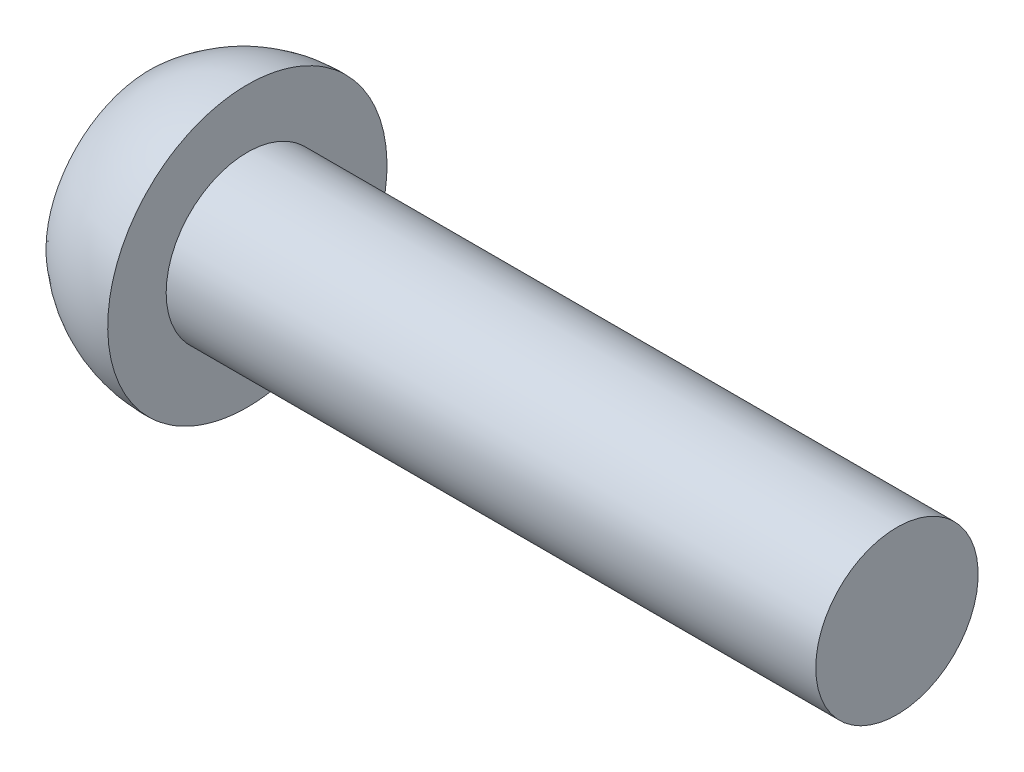
ISO-10303-21;
HEADER;
FILE_DESCRIPTION(('STEP AP214'),'2;1');
FILE_NAME('part.step','',(''),(''),'','','');
FILE_SCHEMA(('AUTOMOTIVE_DESIGN { 1 0 10303 214 1 1 1 1 }'));
ENDSEC;
DATA;
#1=APPLICATION_CONTEXT('core data for automotive mechanical design processes');
#2=APPLICATION_PROTOCOL_DEFINITION('international standard','automotive_design',2000,#1);
#3=PRODUCT_CONTEXT('',#1,'mechanical');
#4=PRODUCT('Part','Part','',(#3));
#5=PRODUCT_RELATED_PRODUCT_CATEGORY('part','',(#4));
#6=PRODUCT_DEFINITION_FORMATION('','',#4);
#7=PRODUCT_DEFINITION_CONTEXT('part definition',#1,'design');
#8=PRODUCT_DEFINITION('design','',#6,#7);
#9=PRODUCT_DEFINITION_SHAPE('','',#8);
#10=(LENGTH_UNIT() NAMED_UNIT(*) SI_UNIT(.MILLI.,.METRE.));
#11=(NAMED_UNIT(*) PLANE_ANGLE_UNIT() SI_UNIT($,.RADIAN.));
#12=(NAMED_UNIT(*) SI_UNIT($,.STERADIAN.) SOLID_ANGLE_UNIT());
#13=UNCERTAINTY_MEASURE_WITH_UNIT(LENGTH_MEASURE(1.E-05),#10,'distance_accuracy_value','');
#14=(GEOMETRIC_REPRESENTATION_CONTEXT(3) GLOBAL_UNCERTAINTY_ASSIGNED_CONTEXT((#13)) GLOBAL_UNIT_ASSIGNED_CONTEXT((#10,
#11,#12)) REPRESENTATION_CONTEXT('',''));
#15=CARTESIAN_POINT('',(0.,0.,0.));
#16=DIRECTION('',(0.,0.,1.));
#17=DIRECTION('',(1.,0.,0.));
#18=AXIS2_PLACEMENT_3D('',#15,#16,#17);
#19=CARTESIAN_POINT('',(1.3,0.,0.));
#20=DIRECTION('',(-1.,0.,0.));
#21=DIRECTION('',(0.,0.,1.));
#22=AXIS2_PLACEMENT_3D('',#19,#20,#21);
#23=PLANE('',#22);
#24=DIRECTION('',(0.,0.866025403784439,-0.5));
#25=VECTOR('',#24,1.);
#26=CARTESIAN_POINT('',(1.3,0.,-0.866025403784439));
#27=LINE('',#26,#25);
#28=CARTESIAN_POINT('',(1.3,0.,-0.866025403784439));
#29=VERTEX_POINT('',#28);
#30=CARTESIAN_POINT('',(1.3,-0.75,-0.43301270189222));
#31=VERTEX_POINT('',#30);
#32=EDGE_CURVE('E122',#29,#31,#27,.F.);
#33=ORIENTED_EDGE('',*,*,#32,.T.);
#34=DIRECTION('',(0.,0.,-1.));
#35=VECTOR('',#34,1.);
#36=CARTESIAN_POINT('',(1.3,-0.75,-0.43301270189222));
#37=LINE('',#36,#35);
#38=CARTESIAN_POINT('',(1.3,-0.75,0.433012701892219));
#39=VERTEX_POINT('',#38);
#40=EDGE_CURVE('E117',#31,#39,#37,.F.);
#41=ORIENTED_EDGE('',*,*,#40,.T.);
#42=DIRECTION('',(0.,-0.866025403784439,-0.5));
#43=VECTOR('',#42,1.);
#44=CARTESIAN_POINT('',(1.3,-0.75,0.433012701892219));
#45=LINE('',#44,#43);
#46=CARTESIAN_POINT('',(1.3,0.,0.866025403784439));
#47=VERTEX_POINT('',#46);
#48=EDGE_CURVE('E95',#39,#47,#45,.F.);
#49=ORIENTED_EDGE('',*,*,#48,.T.);
#50=DIRECTION('',(0.,-0.866025403784439,0.5));
#51=VECTOR('',#50,1.);
#52=CARTESIAN_POINT('',(1.3,0.,0.866025403784439));
#53=LINE('',#52,#51);
#54=CARTESIAN_POINT('',(1.3,0.750000000000001,0.433012701892219));
#55=VERTEX_POINT('',#54);
#56=EDGE_CURVE('E94',#47,#55,#53,.F.);
#57=ORIENTED_EDGE('',*,*,#56,.T.);
#58=DIRECTION('',(0.,0.,1.));
#59=VECTOR('',#58,1.);
#60=CARTESIAN_POINT('',(1.3,0.750000000000001,0.433012701892219));
#61=LINE('',#60,#59);
#62=CARTESIAN_POINT('',(1.3,0.750000000000001,-0.43301270189222));
#63=VERTEX_POINT('',#62);
#64=EDGE_CURVE('E132',#55,#63,#61,.F.);
#65=ORIENTED_EDGE('',*,*,#64,.T.);
#66=DIRECTION('',(0.,0.866025403784439,0.5));
#67=VECTOR('',#66,1.);
#68=CARTESIAN_POINT('',(1.3,0.750000000000001,-0.43301270189222));
#69=LINE('',#68,#67);
#70=EDGE_CURVE('E127',#63,#29,#69,.F.);
#71=ORIENTED_EDGE('',*,*,#70,.T.);
#72=EDGE_LOOP('',(#33,#41,#49,#57,#65,#71));
#73=FACE_BOUND('',#72,.T.);
#74=ADVANCED_FACE('F17',(#73),#23,.T.);
#75=CARTESIAN_POINT('',(1.3,0.750000000000001,0.433012701892219));
#76=DIRECTION('',(0.,1.,0.));
#77=DIRECTION('',(0.,0.,1.));
#78=AXIS2_PLACEMENT_3D('',#75,#76,#77);
#79=PLANE('',#78);
#80=DIRECTION('',(1.,0.,0.));
#81=VECTOR('',#80,1.);
#82=CARTESIAN_POINT('',(1.3,0.750000000000001,-0.43301270189222));
#83=LINE('',#82,#81);
#84=CARTESIAN_POINT('',(0.,0.750000000000001,-0.43301270189222));
#85=VERTEX_POINT('',#84);
#86=EDGE_CURVE('E129',#85,#63,#83,.T.);
#87=ORIENTED_EDGE('',*,*,#86,.T.);
#88=ORIENTED_EDGE('',*,*,#64,.F.);
#89=DIRECTION('',(1.,0.,0.));
#90=VECTOR('',#89,1.);
#91=CARTESIAN_POINT('',(1.3,0.750000000000001,0.433012701892219));
#92=LINE('',#91,#90);
#93=CARTESIAN_POINT('',(0.,0.750000000000001,0.433012701892219));
#94=VERTEX_POINT('',#93);
#95=EDGE_CURVE('E112',#55,#94,#92,.F.);
#96=ORIENTED_EDGE('',*,*,#95,.T.);
#97=DIRECTION('',(0.,0.,-1.));
#98=VECTOR('',#97,1.);
#99=CARTESIAN_POINT('',(0.,0.750000000000001,0.));
#100=LINE('',#99,#98);
#101=EDGE_CURVE('E99',#94,#85,#100,.T.);
#102=ORIENTED_EDGE('',*,*,#101,.T.);
#103=EDGE_LOOP('',(#87,#88,#96,#102));
#104=FACE_BOUND('',#103,.T.);
#105=ADVANCED_FACE('F167',(#104),#79,.F.);
#106=CARTESIAN_POINT('',(1.3,0.750000000000001,-0.43301270189222));
#107=DIRECTION('',(0.,0.5,-0.866025403784439));
#108=DIRECTION('',(0.,0.866025403784439,0.5));
#109=AXIS2_PLACEMENT_3D('',#106,#107,#108);
#110=PLANE('',#109);
#111=DIRECTION('',(1.,0.,0.));
#112=VECTOR('',#111,1.);
#113=CARTESIAN_POINT('',(1.3,0.,-0.866025403784439));
#114=LINE('',#113,#112);
#115=CARTESIAN_POINT('',(0.,0.,-0.866025403784439));
#116=VERTEX_POINT('',#115);
#117=EDGE_CURVE('E124',#116,#29,#114,.T.);
#118=ORIENTED_EDGE('',*,*,#117,.T.);
#119=ORIENTED_EDGE('',*,*,#70,.F.);
#120=ORIENTED_EDGE('',*,*,#86,.F.);
#121=DIRECTION('',(0.,-0.866025403784439,-0.5));
#122=VECTOR('',#121,1.);
#123=CARTESIAN_POINT('',(0.,0.750000000000001,-0.43301270189222));
#124=LINE('',#123,#122);
#125=EDGE_CURVE('E109',#85,#116,#124,.T.);
#126=ORIENTED_EDGE('',*,*,#125,.T.);
#127=EDGE_LOOP('',(#118,#119,#120,#126));
#128=FACE_BOUND('',#127,.T.);
#129=ADVANCED_FACE('F164',(#128),#110,.F.);
#130=CARTESIAN_POINT('',(1.3,0.,-0.866025403784439));
#131=DIRECTION('',(0.,-0.5,-0.866025403784439));
#132=DIRECTION('',(0.,0.866025403784439,-0.5));
#133=AXIS2_PLACEMENT_3D('',#130,#131,#132);
#134=PLANE('',#133);
#135=DIRECTION('',(1.,0.,0.));
#136=VECTOR('',#135,1.);
#137=CARTESIAN_POINT('',(1.3,-0.75,-0.43301270189222));
#138=LINE('',#137,#136);
#139=CARTESIAN_POINT('',(0.,-0.75,-0.43301270189222));
#140=VERTEX_POINT('',#139);
#141=EDGE_CURVE('E119',#140,#31,#138,.T.);
#142=ORIENTED_EDGE('',*,*,#141,.T.);
#143=ORIENTED_EDGE('',*,*,#32,.F.);
#144=ORIENTED_EDGE('',*,*,#117,.F.);
#145=DIRECTION('',(0.,-0.866025403784439,0.5));
#146=VECTOR('',#145,1.);
#147=CARTESIAN_POINT('',(0.,0.,-0.866025403784439));
#148=LINE('',#147,#146);
#149=EDGE_CURVE('E107',#116,#140,#148,.T.);
#150=ORIENTED_EDGE('',*,*,#149,.T.);
#151=EDGE_LOOP('',(#142,#143,#144,#150));
#152=FACE_BOUND('',#151,.T.);
#153=ADVANCED_FACE('F160',(#152),#134,.F.);
#154=CARTESIAN_POINT('',(1.3,-0.75,-0.43301270189222));
#155=DIRECTION('',(0.,-1.,0.));
#156=DIRECTION('',(0.,0.,-1.));
#157=AXIS2_PLACEMENT_3D('',#154,#155,#156);
#158=PLANE('',#157);
#159=DIRECTION('',(1.,0.,0.));
#160=VECTOR('',#159,1.);
#161=CARTESIAN_POINT('',(1.3,-0.75,0.433012701892219));
#162=LINE('',#161,#160);
#163=CARTESIAN_POINT('',(0.,-0.75,0.433012701892219));
#164=VERTEX_POINT('',#163);
#165=EDGE_CURVE('E82',#164,#39,#162,.T.);
#166=ORIENTED_EDGE('',*,*,#165,.T.);
#167=ORIENTED_EDGE('',*,*,#40,.F.);
#168=ORIENTED_EDGE('',*,*,#141,.F.);
#169=DIRECTION('',(0.,0.,-1.));
#170=VECTOR('',#169,1.);
#171=CARTESIAN_POINT('',(0.,-0.75,0.));
#172=LINE('',#171,#170);
#173=EDGE_CURVE('E87',#140,#164,#172,.F.);
#174=ORIENTED_EDGE('',*,*,#173,.T.);
#175=EDGE_LOOP('',(#166,#167,#168,#174));
#176=FACE_BOUND('',#175,.T.);
#177=ADVANCED_FACE('F157',(#176),#158,.F.);
#178=CARTESIAN_POINT('',(1.3,-0.75,0.433012701892219));
#179=DIRECTION('',(0.,-0.5,0.866025403784439));
#180=DIRECTION('',(0.,-0.866025403784439,-0.5));
#181=AXIS2_PLACEMENT_3D('',#178,#179,#180);
#182=PLANE('',#181);
#183=DIRECTION('',(1.,0.,0.));
#184=VECTOR('',#183,1.);
#185=CARTESIAN_POINT('',(1.3,0.,0.866025403784439));
#186=LINE('',#185,#184);
#187=CARTESIAN_POINT('',(0.,0.,0.866025403784439));
#188=VERTEX_POINT('',#187);
#189=EDGE_CURVE('E79',#188,#47,#186,.T.);
#190=ORIENTED_EDGE('',*,*,#189,.T.);
#191=ORIENTED_EDGE('',*,*,#48,.F.);
#192=ORIENTED_EDGE('',*,*,#165,.F.);
#193=DIRECTION('',(0.,0.866025403784439,0.5));
#194=VECTOR('',#193,1.);
#195=CARTESIAN_POINT('',(0.,-0.75,0.433012701892219));
#196=LINE('',#195,#194);
#197=EDGE_CURVE('E75',#164,#188,#196,.T.);
#198=ORIENTED_EDGE('',*,*,#197,.T.);
#199=EDGE_LOOP('',(#190,#191,#192,#198));
#200=FACE_BOUND('',#199,.T.);
#201=ADVANCED_FACE('F77',(#200),#182,.F.);
#202=CARTESIAN_POINT('',(1.3,0.,0.866025403784439));
#203=DIRECTION('',(0.,0.5,0.866025403784439));
#204=DIRECTION('',(0.,-0.866025403784439,0.5));
#205=AXIS2_PLACEMENT_3D('',#202,#203,#204);
#206=PLANE('',#205);
#207=ORIENTED_EDGE('',*,*,#95,.F.);
#208=ORIENTED_EDGE('',*,*,#56,.F.);
#209=ORIENTED_EDGE('',*,*,#189,.F.);
#210=DIRECTION('',(0.,0.866025403784438,-0.5));
#211=VECTOR('',#210,1.);
#212=CARTESIAN_POINT('',(0.,0.,0.866025403784439));
#213=LINE('',#212,#211);
#214=EDGE_CURVE('E86',#188,#94,#213,.T.);
#215=ORIENTED_EDGE('',*,*,#214,.T.);
#216=EDGE_LOOP('',(#207,#208,#209,#215));
#217=FACE_BOUND('',#216,.T.);
#218=ADVANCED_FACE('F92',(#217),#206,.F.);
#219=CARTESIAN_POINT('',(0.,0.,0.));
#220=DIRECTION('',(1.,0.,0.));
#221=DIRECTION('',(0.,0.,-1.));
#222=AXIS2_PLACEMENT_3D('',#219,#220,#221);
#223=PLANE('',#222);
#224=CARTESIAN_POINT('',(0.,-1.6,0.));
#225=CARTESIAN_POINT('',(0.,-1.59999491518665,-0.0898058509638306));
#226=CARTESIAN_POINT('',(0.,-1.59239736388203,-0.179771530910243));
#227=CARTESIAN_POINT('',(0.,-1.56978992308509,-0.312728167692751));
#228=CARTESIAN_POINT('',(0.,-1.56036587642752,-0.356771412883457));
#229=CARTESIAN_POINT('',(0.,-1.53783419346895,-0.443950963914646));
#230=CARTESIAN_POINT('',(0.,-1.5247235679119,-0.48708650310837));
#231=CARTESIAN_POINT('',(0.,-1.48004217995571,-0.614451130943199));
#232=CARTESIAN_POINT('',(0.,-1.44308520787159,-0.696852605605152));
#233=CARTESIAN_POINT('',(0.,-1.35584377899948,-0.85427489605982));
#234=CARTESIAN_POINT('',(0.,-1.30555881557725,-0.929295431133681));
#235=CARTESIAN_POINT('',(0.,-1.22127322709011,-1.03466103704234));
#236=CARTESIAN_POINT('',(0.,-1.19167941852751,-1.06860855571372));
#237=CARTESIAN_POINT('',(0.,-1.1297705032421,-1.13386057270216));
#238=CARTESIAN_POINT('',(0.,-1.09745804777059,-1.16516758773178));
#239=CARTESIAN_POINT('',(0.,-0.996701026779465,-1.25485382359385));
#240=CARTESIAN_POINT('',(4.88071489761702E-13,-0.924418538826696,-1.30902102616723));
#241=CARTESIAN_POINT('',(5.06358398008253E-13,-0.771824869028212,-1.40441928098726));
#242=CARTESIAN_POINT('',(1.25899995619696E-13,-0.691513990071576,-1.44565082101812));
#243=CARTESIAN_POINT('',(-1.2633232947423E-13,-0.525101026398086,-1.51405320165092));
#244=CARTESIAN_POINT('',(0.,-0.438999003544449,-1.5412241924261));
#245=CARTESIAN_POINT('',(0.,-0.263457424015022,-1.58072311132482));
#246=CARTESIAN_POINT('',(0.,-0.174017849517922,-1.59305096017971));
#247=CARTESIAN_POINT('',(0.,0.00566154321391756,-1.60251724502694));
#248=CARTESIAN_POINT('',(0.,0.0959013614486572,-1.59965568101928));
#249=CARTESIAN_POINT('',(0.,0.274621585558607,-1.57882080084403));
#250=CARTESIAN_POINT('',(0.,0.36310200082716,-1.56084756537889));
#251=CARTESIAN_POINT('',(0.,0.535781232283187,-1.51031002311048));
#252=CARTESIAN_POINT('',(0.,0.619980002729658,-1.47774556046492));
#253=CARTESIAN_POINT('',(0.,0.781753087162714,-1.39890950121346));
#254=CARTESIAN_POINT('',(0.,0.859327151191862,-1.35263738769698));
#255=CARTESIAN_POINT('',(0.,0.968950348090436,-1.27403488847543));
#256=CARTESIAN_POINT('',(0.,1.00437357091571,-1.24629648092676));
#257=CARTESIAN_POINT('',(0.,1.07279624806872,-1.18791089397156));
#258=CARTESIAN_POINT('',(0.,1.10579333027074,-1.15726093319933));
#259=CARTESIAN_POINT('',(0.,1.20068381960412,-1.06133509533902));
#260=CARTESIAN_POINT('',(0.,1.25857334024562,-0.992013658329663));
#261=CARTESIAN_POINT('',(0.,1.36187326511285,-0.844629907644365));
#262=CARTESIAN_POINT('',(0.,1.40728414367107,-0.766567926368835));
#263=CARTESIAN_POINT('',(0.,1.46510126811183,-0.644603361947047));
#264=CARTESIAN_POINT('',(0.,1.48267186599164,-0.603084241843454));
#265=CARTESIAN_POINT('',(0.,1.51423937825136,-0.5187548695899));
#266=CARTESIAN_POINT('',(0.,1.52823918478214,-0.475945693944563));
#267=CARTESIAN_POINT('',(0.,1.56469215271815,-0.346100614051025));
#268=CARTESIAN_POINT('',(0.,1.58170096526363,-0.257431303408398));
#269=CARTESIAN_POINT('',(0.,1.59409497697703,-0.140196048457547));
#270=CARTESIAN_POINT('',(0.,1.59630744933613,-0.112206483865384));
#271=CARTESIAN_POINT('',(0.,1.59926075587053,-0.0561498224386112));
#272=CARTESIAN_POINT('',(0.,1.60000159004582,-0.0280827256040015));
#273=CARTESIAN_POINT('',(0.,1.59999491518664,0.0898058509638303));
#274=CARTESIAN_POINT('',(0.,1.59239736388203,0.179771530910243));
#275=CARTESIAN_POINT('',(0.,1.56978992308509,0.31272816769275));
#276=CARTESIAN_POINT('',(0.,1.56036587642752,0.356771412883456));
#277=CARTESIAN_POINT('',(0.,1.53783419346895,0.443950963914646));
#278=CARTESIAN_POINT('',(0.,1.5247235679119,0.48708650310837));
#279=CARTESIAN_POINT('',(0.,1.48004217995571,0.614451130943199));
#280=CARTESIAN_POINT('',(0.,1.44308520787159,0.696852605605151));
#281=CARTESIAN_POINT('',(0.,1.35584377899948,0.85427489605982));
#282=CARTESIAN_POINT('',(0.,1.30555881557725,0.929295431133682));
#283=CARTESIAN_POINT('',(0.,1.22127322709011,1.03466103704234));
#284=CARTESIAN_POINT('',(0.,1.19167941852751,1.06860855571372));
#285=CARTESIAN_POINT('',(0.,1.1297705032421,1.13386057270216));
#286=CARTESIAN_POINT('',(0.,1.09745804777059,1.16516758773178));
#287=CARTESIAN_POINT('',(0.,0.996701026779466,1.25485382359385));
#288=CARTESIAN_POINT('',(4.88857800109033E-13,0.924418538826696,1.30902102616723));
#289=CARTESIAN_POINT('',(5.07306808080206E-13,0.771824869028211,1.40441928098726));
#290=CARTESIAN_POINT('',(1.26617553826069E-13,0.691513990071576,1.44565082101812));
#291=CARTESIAN_POINT('',(-1.27049880016587E-13,0.525101026398085,1.51405320165092));
#292=CARTESIAN_POINT('',(0.,0.438999003544449,1.5412241924261));
#293=CARTESIAN_POINT('',(0.,0.263457424015022,1.58072311132482));
#294=CARTESIAN_POINT('',(0.,0.174017849517922,1.59305096017971));
#295=CARTESIAN_POINT('',(0.,-0.00566154321391741,1.60251724502694));
#296=CARTESIAN_POINT('',(0.,-0.0959013614486569,1.59965568101928));
#297=CARTESIAN_POINT('',(0.,-0.274621585558607,1.57882080084403));
#298=CARTESIAN_POINT('',(0.,-0.36310200082716,1.56084756537889));
#299=CARTESIAN_POINT('',(0.,-0.535781232283187,1.51031002311048));
#300=CARTESIAN_POINT('',(0.,-0.619980002729657,1.47774556046492));
#301=CARTESIAN_POINT('',(0.,-0.781753087162714,1.39890950121346));
#302=CARTESIAN_POINT('',(0.,-0.859327151191862,1.35263738769698));
#303=CARTESIAN_POINT('',(0.,-0.968950348090436,1.27403488847543));
#304=CARTESIAN_POINT('',(0.,-1.00437357091571,1.24629648092676));
#305=CARTESIAN_POINT('',(0.,-1.07279624806872,1.18791089397156));
#306=CARTESIAN_POINT('',(0.,-1.10579333027074,1.15726093319933));
#307=CARTESIAN_POINT('',(0.,-1.20068381960412,1.06133509533902));
#308=CARTESIAN_POINT('',(0.,-1.25857334024562,0.992013658329663));
#309=CARTESIAN_POINT('',(0.,-1.36187326511285,0.844629907644366));
#310=CARTESIAN_POINT('',(0.,-1.40728414367107,0.766567926368836));
#311=CARTESIAN_POINT('',(0.,-1.46510126811183,0.644603361947048));
#312=CARTESIAN_POINT('',(0.,-1.48267186599164,0.603084241843456));
#313=CARTESIAN_POINT('',(0.,-1.51423937825136,0.518754869589902));
#314=CARTESIAN_POINT('',(0.,-1.52823918478214,0.475945693944565));
#315=CARTESIAN_POINT('',(0.,-1.56469215271815,0.346100614051027));
#316=CARTESIAN_POINT('',(0.,-1.58170096526363,0.257431303408399));
#317=CARTESIAN_POINT('',(0.,-1.59409497697703,0.140196048457548));
#318=CARTESIAN_POINT('',(0.,-1.59630744933613,0.112206483865385));
#319=CARTESIAN_POINT('',(0.,-1.59926075587053,0.0561498224386115));
#320=CARTESIAN_POINT('',(0.,-1.60000159004582,0.0280827256040015));
#321=CARTESIAN_POINT('',(0.,-1.6,0.));
#322=B_SPLINE_CURVE_WITH_KNOTS('',3,(#224,#225,#226,#227,#228,#229,#230,#231,#232,#233,#234,
#235,#236,#237,#238,#239,#240,#241,#242,#243,#244,#245,#246,#247,#248,#249,#250,#251,#252,#253,
#254,#255,#256,#257,#258,#259,#260,#261,#262,#263,#264,#265,#266,#267,#268,#269,#270,#271,#272,
#273,#274,#275,#276,#277,#278,#279,#280,#281,#282,#283,#284,#285,#286,#287,#288,#289,#290,#291,
#292,#293,#294,#295,#296,#297,#298,#299,#300,#301,#302,#303,#304,#305,#306,#307,#308,#309,#310,
#311,#312,#313,#314,#315,#316,#317,#318,#319,#320,#321),.UNSPECIFIED.,.T.,.F.,(4,2,2,2,2,2,2,2,
2,2,2,2,2,2,2,2,2,2,2,2,2,2,2,2,2,2,2,2,2,2,2,2,2,2,2,2,2,2,2,2,2,2,2,2,2,2,2,2,4),(0.,
0.269286876383114,0.404284233131455,0.539391369473015,0.808961602399114,1.07854208391437,
1.21350895024238,1.34834568818316,1.617932651975,1.88750944882891,2.15708336641741,
2.42665872363845,2.69623408085947,2.96580799844775,3.23538479530147,3.50497175909352,
3.63980849703439,3.7747753633625,4.04435584487776,4.31392607780385,4.44903321414541,
4.58403057089376,4.85331744727686,4.93752476091026,5.02173207454366,5.29101895092678,
5.42601630767512,5.56112344401668,5.83069367694277,6.10027415845803,6.23524102478604,
6.37007776272682,6.63966472651866,6.90924152337257,7.17881544096107,7.44839079818211,
7.71796615540313,7.98754007299141,8.25711686984513,8.52670383363718,8.66154057157805,
8.79650743790615,9.06608791942142,9.33565815234751,9.47076528868907,9.60576264543741,
9.87504952182052,9.95925683545392,10.0434641490873),.UNSPECIFIED.);
#323=CARTESIAN_POINT('',(0.,-1.6,0.));
#324=VERTEX_POINT('',#323);
#325=EDGE_CURVE('E20',#324,#324,#322,.T.);
#326=ORIENTED_EDGE('',*,*,#325,.F.);
#327=EDGE_LOOP('',(#326));
#328=FACE_BOUND('',#327,.T.);
#329=ORIENTED_EDGE('',*,*,#197,.F.);
#330=ORIENTED_EDGE('',*,*,#173,.F.);
#331=ORIENTED_EDGE('',*,*,#149,.F.);
#332=ORIENTED_EDGE('',*,*,#125,.F.);
#333=ORIENTED_EDGE('',*,*,#101,.F.);
#334=ORIENTED_EDGE('',*,*,#214,.F.);
#335=EDGE_LOOP('',(#329,#330,#331,#332,#333,#334));
#336=FACE_BOUND('',#335,.T.);
#337=ADVANCED_FACE('F97',(#328,#336),#223,.F.);
#338=CARTESIAN_POINT('',(1.4375,0.,0.));
#339=DIRECTION('',(0.,1.,0.));
#340=DIRECTION('',(1.,0.,0.));
#341=AXIS2_PLACEMENT_3D('',#338,#339,#340);
#342=SPHERICAL_SURFACE('',#341,2.15090823839605);
#343=CARTESIAN_POINT('',(1.4375,-2.15090823839605,0.));
#344=VERTEX_POINT('',#343);
#345=VERTEX_LOOP('',#344);
#346=FACE_BOUND('',#345,.T.);
#347=ORIENTED_EDGE('',*,*,#325,.T.);
#348=EDGE_LOOP('',(#347));
#349=FACE_BOUND('',#348,.T.);
#350=CARTESIAN_POINT('',(1.4375,2.15090823839605,0.));
#351=VERTEX_POINT('',#350);
#352=VERTEX_LOOP('',#351);
#353=FACE_BOUND('',#352,.T.);
#354=CARTESIAN_POINT('',(1.5,2.15,0.));
#355=CARTESIAN_POINT('',(1.5,2.15000194881513,-0.0417023449235325));
#356=CARTESIAN_POINT('',(1.5,2.14878865123496,-0.0833885497757018));
#357=CARTESIAN_POINT('',(1.5,2.14147104870236,-0.208930779039776));
#358=CARTESIAN_POINT('',(1.5,2.13165055366437,-0.292611718795644));
#359=CARTESIAN_POINT('',(1.5,2.1022820158594,-0.4582644510479));
#360=CARTESIAN_POINT('',(1.5,2.08272685260388,-0.540234946632332));
#361=CARTESIAN_POINT('',(1.5,2.02352907898033,-0.736474315288249));
#362=CARTESIAN_POINT('',(1.5,1.9788475638686,-0.849266951314007));
#363=CARTESIAN_POINT('',(1.5,1.87116870584914,-1.06577214667726));
#364=CARTESIAN_POINT('',(1.5,1.80816103642581,-1.16947954362841));
#365=CARTESIAN_POINT('',(1.5,1.66563732977233,-1.36483001021981));
#366=CARTESIAN_POINT('',(1.5,1.58612495178565,-1.45647574669247));
#367=CARTESIAN_POINT('',(1.5,1.41285336147538,-1.62510324405852));
#368=CARTESIAN_POINT('',(1.5,1.31909587907287,-1.70208678296994));
#369=CARTESIAN_POINT('',(1.5,1.11998255388432,-1.83922602414585));
#370=CARTESIAN_POINT('',(1.5,1.01462612431089,-1.89938087450621));
#371=CARTESIAN_POINT('',(1.5,0.795307426581564,-2.00114992801177));
#372=CARTESIAN_POINT('',(1.5,0.68134498522812,-2.04276375789921));
#373=CARTESIAN_POINT('',(1.5,0.448052328533607,-2.10626766011517));
#374=CARTESIAN_POINT('',(1.5,0.328722164347011,-2.12815792036779));
#375=CARTESIAN_POINT('',(1.5,0.0880806231999164,-2.15159387574276));
#376=CARTESIAN_POINT('',(1.5,-0.0332307516323021,-2.15313959271843));
#377=CARTESIAN_POINT('',(1.5,-0.274390858410683,-2.13584268108904));
#378=CARTESIAN_POINT('',(1.5,-0.394239594133713,-2.11700010514248));
#379=CARTESIAN_POINT('',(1.5,-0.629073343347095,-2.059461391388));
#380=CARTESIAN_POINT('',(1.5,-0.744058326484485,-2.02076512970002));
#381=CARTESIAN_POINT('',(1.5,-0.965902598714161,-1.92461617434441));
#382=CARTESIAN_POINT('',(1.5,-1.07276167396357,-1.86716298727656));
#383=CARTESIAN_POINT('',(1.5,-1.27531121562044,-1.73513540476093));
#384=CARTESIAN_POINT('',(1.5,-1.3710023389562,-1.6605620171348));
#385=CARTESIAN_POINT('',(1.5,-1.54849525163682,-1.4964197406206));
#386=CARTESIAN_POINT('',(1.5,-1.63029887161993,-1.40685283126133));
#387=CARTESIAN_POINT('',(1.5,-1.77773477022427,-1.21522777349059));
#388=CARTESIAN_POINT('',(1.5,-1.84336182116283,-1.11316560296824));
#389=CARTESIAN_POINT('',(1.5,-1.95657809193535,-0.899409031691173));
#390=CARTESIAN_POINT('',(1.5,-2.00415713958652,-0.787709242400132));
#391=CARTESIAN_POINT('',(1.5,-2.07981939663487,-0.558075165234218));
#392=CARTESIAN_POINT('',(1.5,-2.10793072450907,-0.440150135138358));
#393=CARTESIAN_POINT('',(1.5,-2.14195519875807,-0.214566205339848));
#394=CARTESIAN_POINT('',(1.5,-2.14999498898797,-0.107229746449133));
#395=CARTESIAN_POINT('',(1.5,-2.15000194881513,0.0417023449235321));
#396=CARTESIAN_POINT('',(1.5,-2.14878865123497,0.0833885497757011));
#397=CARTESIAN_POINT('',(1.5,-2.14147104870237,0.208930779039775));
#398=CARTESIAN_POINT('',(1.5,-2.13165055366437,0.292611718795642));
#399=CARTESIAN_POINT('',(1.5,-2.1022820158594,0.458264451047898));
#400=CARTESIAN_POINT('',(1.5,-2.08272685260388,0.54023494663233));
#401=CARTESIAN_POINT('',(1.5,-2.02352907898033,0.736474315288246));
#402=CARTESIAN_POINT('',(1.5,-1.9788475638686,0.849266951314004));
#403=CARTESIAN_POINT('',(1.5,-1.87116870584915,1.06577214667726));
#404=CARTESIAN_POINT('',(1.5,-1.80816103642582,1.1694795436284));
#405=CARTESIAN_POINT('',(1.5,-1.66563732977233,1.36483001021981));
#406=CARTESIAN_POINT('',(1.5,-1.58612495178565,1.45647574669246));
#407=CARTESIAN_POINT('',(1.5,-1.41285336147538,1.62510324405852));
#408=CARTESIAN_POINT('',(1.5,-1.31909587907288,1.70208678296994));
#409=CARTESIAN_POINT('',(1.5,-1.11998255388432,1.83922602414584));
#410=CARTESIAN_POINT('',(1.5,-1.01462612431089,1.89938087450621));
#411=CARTESIAN_POINT('',(1.5,-0.795307426581569,2.00114992801176));
#412=CARTESIAN_POINT('',(1.5,-0.681344985228125,2.0427637578992));
#413=CARTESIAN_POINT('',(1.5,-0.448052328533612,2.10626766011517));
#414=CARTESIAN_POINT('',(1.5,-0.328722164347016,2.12815792036779));
#415=CARTESIAN_POINT('',(1.5,-0.0880806231999221,2.15159387574276));
#416=CARTESIAN_POINT('',(1.5,0.0332307516322963,2.15313959271843));
#417=CARTESIAN_POINT('',(1.5,0.274390858410678,2.13584268108904));
#418=CARTESIAN_POINT('',(1.5,0.394239594133708,2.11700010514248));
#419=CARTESIAN_POINT('',(1.5,0.62907334334709,2.059461391388));
#420=CARTESIAN_POINT('',(1.5,0.744058326484479,2.02076512970002));
#421=CARTESIAN_POINT('',(1.5,0.965902598714156,1.92461617434441));
#422=CARTESIAN_POINT('',(1.5,1.07276167396357,1.86716298727656));
#423=CARTESIAN_POINT('',(1.5,1.27531121562043,1.73513540476093));
#424=CARTESIAN_POINT('',(1.5,1.3710023389562,1.66056201713481));
#425=CARTESIAN_POINT('',(1.5,1.54849525163682,1.4964197406206));
#426=CARTESIAN_POINT('',(1.5,1.63029887161992,1.40685283126133));
#427=CARTESIAN_POINT('',(1.5,1.77773477022426,1.21522777349059));
#428=CARTESIAN_POINT('',(1.5,1.84336182116283,1.11316560296825));
#429=CARTESIAN_POINT('',(1.5,1.95657809193535,0.899409031691177));
#430=CARTESIAN_POINT('',(1.5,2.00415713958652,0.787709242400137));
#431=CARTESIAN_POINT('',(1.5,2.07981939663487,0.558075165234223));
#432=CARTESIAN_POINT('',(1.5,2.10793072450906,0.440150135138363));
#433=CARTESIAN_POINT('',(1.5,2.14195519875807,0.214566205339852));
#434=CARTESIAN_POINT('',(1.5,2.14999498898797,0.107229746449135));
#435=CARTESIAN_POINT('',(1.5,2.15,0.));
#436=B_SPLINE_CURVE_WITH_KNOTS('',3,(#354,#355,#356,#357,#358,#359,#360,#361,#362,#363,#364,
#365,#366,#367,#368,#369,#370,#371,#372,#373,#374,#375,#376,#377,#378,#379,#380,#381,#382,#383,
#384,#385,#386,#387,#388,#389,#390,#391,#392,#393,#394,#395,#396,#397,#398,#399,#400,#401,#402,
#403,#404,#405,#406,#407,#408,#409,#410,#411,#412,#413,#414,#415,#416,#417,#418,#419,#420,#421,
#422,#423,#424,#425,#426,#427,#428,#429,#430,#431,#432,#433,#434,#435),.UNSPECIFIED.,.T.,.F.,(4,
2,2,2,2,2,2,2,2,2,2,2,2,2,2,2,2,2,2,2,2,2,2,2,2,2,2,2,2,2,2,2,2,2,2,2,2,2,2,2,4),(0.,
0.125070513396188,0.37717968802038,0.629473541156357,0.991613198837862,1.35395731348212,
1.71622117879358,2.07844108600419,2.44067932624288,2.80292485853565,3.16516693935465,
3.52740863106733,3.88964938719153,4.25189240359897,4.61414494956322,4.97637617612851,
5.33855961655977,5.70085994859264,6.06336417734087,6.42534371976705,6.74693905126046,
6.87200956465665,7.12411873928084,7.37641259241682,7.73855225009832,8.10089636474257,
8.46316023005404,8.82538013726465,9.18761837750333,9.54986390979611,9.91210599061511,
10.2743476823278,10.636588438452,10.9988314548594,11.3610840008237,11.723315227389,
12.0854986678202,12.4477989998531,12.8103032286013,13.1722827710275,13.4938781025209),.UNSPECIFIED.);
#437=CARTESIAN_POINT('',(1.5,2.15,0.));
#438=VERTEX_POINT('',#437);
#439=EDGE_CURVE('E102',#438,#438,#436,.T.);
#440=ORIENTED_EDGE('',*,*,#439,.T.);
#441=EDGE_LOOP('',(#440));
#442=FACE_BOUND('',#441,.T.);
#443=ADVANCED_FACE('F143',(#346,#349,#353,#442),#342,.T.);
#444=CARTESIAN_POINT('',(11.5,0.,0.));
#445=DIRECTION('',(-1.,0.,0.));
#446=DIRECTION('',(0.,0.,1.));
#447=AXIS2_PLACEMENT_3D('',#444,#445,#446);
#448=PLANE('',#447);
#449=CARTESIAN_POINT('',(11.5,0.,0.));
#450=DIRECTION('',(-1.,0.,0.));
#451=DIRECTION('',(0.,0.,1.));
#452=AXIS2_PLACEMENT_3D('',#449,#450,#451);
#453=CIRCLE('',#452,1.25);
#454=CARTESIAN_POINT('',(11.5,0.,1.25));
#455=VERTEX_POINT('',#454);
#456=EDGE_CURVE('E30',#455,#455,#453,.T.);
#457=ORIENTED_EDGE('',*,*,#456,.F.);
#458=EDGE_LOOP('',(#457));
#459=FACE_BOUND('',#458,.T.);
#460=ADVANCED_FACE('F146',(#459),#448,.F.);
#461=CARTESIAN_POINT('',(1.5,1.25,0.));
#462=DIRECTION('',(-1.,0.,0.));
#463=DIRECTION('',(0.,0.,1.));
#464=AXIS2_PLACEMENT_3D('',#461,#462,#463);
#465=PLANE('',#464);
#466=CARTESIAN_POINT('',(1.5,0.,0.));
#467=DIRECTION('',(-1.,0.,0.));
#468=DIRECTION('',(0.,0.,1.));
#469=AXIS2_PLACEMENT_3D('',#466,#467,#468);
#470=CIRCLE('',#469,1.25);
#471=CARTESIAN_POINT('',(1.5,0.,1.25));
#472=VERTEX_POINT('',#471);
#473=EDGE_CURVE('E11',#472,#472,#470,.F.);
#474=ORIENTED_EDGE('',*,*,#473,.F.);
#475=EDGE_LOOP('',(#474));
#476=FACE_BOUND('',#475,.T.);
#477=ORIENTED_EDGE('',*,*,#439,.F.);
#478=EDGE_LOOP('',(#477));
#479=FACE_BOUND('',#478,.T.);
#480=ADVANCED_FACE('F139',(#476,#479),#465,.F.);
#481=CARTESIAN_POINT('',(-16.5029441624365,0.,0.));
#482=DIRECTION('',(-1.,0.,0.));
#483=DIRECTION('',(0.,0.,1.));
#484=AXIS2_PLACEMENT_3D('',#481,#482,#483);
#485=CYLINDRICAL_SURFACE('',#484,1.25);
#486=ORIENTED_EDGE('',*,*,#473,.T.);
#487=EDGE_LOOP('',(#486));
#488=FACE_BOUND('',#487,.T.);
#489=ORIENTED_EDGE('',*,*,#456,.T.);
#490=EDGE_LOOP('',(#489));
#491=FACE_BOUND('',#490,.T.);
#492=ADVANCED_FACE('F176',(#488,#491),#485,.T.);
#493=CLOSED_SHELL('',(#74,#105,#129,#153,#177,#201,#218,#337,#443,#460,#480,#492));
#494=MANIFOLD_SOLID_BREP('B1',#493);
#495=ADVANCED_BREP_SHAPE_REPRESENTATION('',(#18,#494),#14);
#496=SHAPE_DEFINITION_REPRESENTATION(#9,#495);
ENDSEC;
END-ISO-10303-21;
